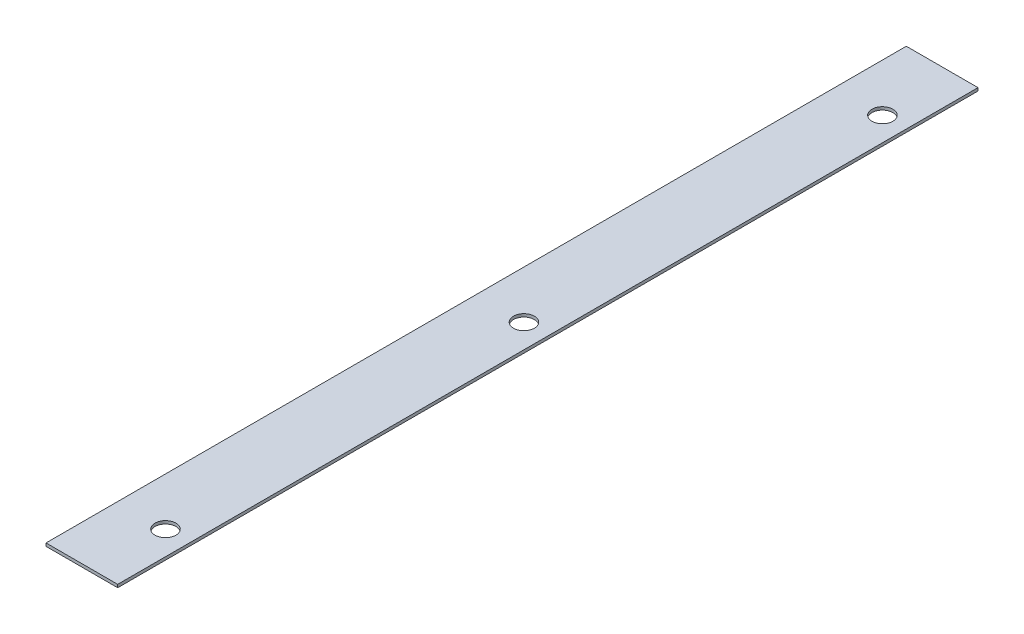
ISO-10303-21;
HEADER;
FILE_DESCRIPTION(('STEP AP214'),'2;1');
FILE_NAME('part.step','',(''),(''),'','','');
FILE_SCHEMA(('AUTOMOTIVE_DESIGN { 1 0 10303 214 1 1 1 1 }'));
ENDSEC;
DATA;
#1=APPLICATION_CONTEXT('core data for automotive mechanical design processes');
#2=APPLICATION_PROTOCOL_DEFINITION('international standard','automotive_design',2000,#1);
#3=PRODUCT_CONTEXT('',#1,'mechanical');
#4=PRODUCT('Part','Part','',(#3));
#5=PRODUCT_RELATED_PRODUCT_CATEGORY('part','',(#4));
#6=PRODUCT_DEFINITION_FORMATION('','',#4);
#7=PRODUCT_DEFINITION_CONTEXT('part definition',#1,'design');
#8=PRODUCT_DEFINITION('design','',#6,#7);
#9=PRODUCT_DEFINITION_SHAPE('','',#8);
#10=(LENGTH_UNIT() NAMED_UNIT(*) SI_UNIT(.MILLI.,.METRE.));
#11=(NAMED_UNIT(*) PLANE_ANGLE_UNIT() SI_UNIT($,.RADIAN.));
#12=(NAMED_UNIT(*) SI_UNIT($,.STERADIAN.) SOLID_ANGLE_UNIT());
#13=UNCERTAINTY_MEASURE_WITH_UNIT(LENGTH_MEASURE(1.E-05),#10,'distance_accuracy_value','');
#14=(GEOMETRIC_REPRESENTATION_CONTEXT(3) GLOBAL_UNCERTAINTY_ASSIGNED_CONTEXT((#13)) GLOBAL_UNIT_ASSIGNED_CONTEXT((#10,
#11,#12)) REPRESENTATION_CONTEXT('',''));
#15=CARTESIAN_POINT('',(0.,0.,0.));
#16=DIRECTION('',(0.,0.,1.));
#17=DIRECTION('',(1.,0.,0.));
#18=AXIS2_PLACEMENT_3D('',#15,#16,#17);
#19=CARTESIAN_POINT('',(0.,3.175,0.));
#20=DIRECTION('',(1.,0.,0.));
#21=DIRECTION('',(0.,0.,-1.));
#22=AXIS2_PLACEMENT_3D('',#19,#20,#21);
#23=PLANE('',#22);
#24=DIRECTION('',(0.,0.,1.));
#25=VECTOR('',#24,1.);
#26=CARTESIAN_POINT('',(0.,0.,0.));
#27=LINE('',#26,#25);
#28=CARTESIAN_POINT('',(0.,0.,-914.4));
#29=VERTEX_POINT('',#28);
#30=CARTESIAN_POINT('',(0.,0.,0.));
#31=VERTEX_POINT('',#30);
#32=EDGE_CURVE('E80',#29,#31,#27,.T.);
#33=ORIENTED_EDGE('',*,*,#32,.T.);
#34=DIRECTION('',(0.,-1.,0.));
#35=VECTOR('',#34,1.);
#36=CARTESIAN_POINT('',(0.,3.175,0.));
#37=LINE('',#36,#35);
#38=CARTESIAN_POINT('',(0.,3.175,0.));
#39=VERTEX_POINT('',#38);
#40=EDGE_CURVE('E11',#39,#31,#37,.T.);
#41=ORIENTED_EDGE('',*,*,#40,.F.);
#42=DIRECTION('',(0.,0.,1.));
#43=VECTOR('',#42,1.);
#44=CARTESIAN_POINT('',(0.,3.175,0.));
#45=LINE('',#44,#43);
#46=CARTESIAN_POINT('',(0.,3.175,-914.4));
#47=VERTEX_POINT('',#46);
#48=EDGE_CURVE('E68',#47,#39,#45,.T.);
#49=ORIENTED_EDGE('',*,*,#48,.F.);
#50=DIRECTION('',(0.,-1.,0.));
#51=VECTOR('',#50,1.);
#52=CARTESIAN_POINT('',(0.,3.175,-914.4));
#53=LINE('',#52,#51);
#54=EDGE_CURVE('E76',#47,#29,#53,.T.);
#55=ORIENTED_EDGE('',*,*,#54,.T.);
#56=EDGE_LOOP('',(#33,#41,#49,#55));
#57=FACE_BOUND('',#56,.T.);
#58=ADVANCED_FACE('F17',(#57),#23,.F.);
#59=CARTESIAN_POINT('',(0.,3.175,0.));
#60=DIRECTION('',(0.,0.,-1.));
#61=DIRECTION('',(-1.,0.,0.));
#62=AXIS2_PLACEMENT_3D('',#59,#60,#61);
#63=PLANE('',#62);
#64=DIRECTION('',(1.,0.,0.));
#65=VECTOR('',#64,1.);
#66=CARTESIAN_POINT('',(0.,0.,0.));
#67=LINE('',#66,#65);
#68=CARTESIAN_POINT('',(76.2,0.,0.));
#69=VERTEX_POINT('',#68);
#70=EDGE_CURVE('E72',#31,#69,#67,.T.);
#71=ORIENTED_EDGE('',*,*,#70,.T.);
#72=DIRECTION('',(0.,-1.,0.));
#73=VECTOR('',#72,1.);
#74=CARTESIAN_POINT('',(76.2,3.175,0.));
#75=LINE('',#74,#73);
#76=CARTESIAN_POINT('',(76.2,3.175,0.));
#77=VERTEX_POINT('',#76);
#78=EDGE_CURVE('E25',#77,#69,#75,.T.);
#79=ORIENTED_EDGE('',*,*,#78,.F.);
#80=DIRECTION('',(1.,0.,0.));
#81=VECTOR('',#80,1.);
#82=CARTESIAN_POINT('',(0.,3.175,0.));
#83=LINE('',#82,#81);
#84=EDGE_CURVE('E63',#39,#77,#83,.T.);
#85=ORIENTED_EDGE('',*,*,#84,.F.);
#86=ORIENTED_EDGE('',*,*,#40,.T.);
#87=EDGE_LOOP('',(#71,#79,#85,#86));
#88=FACE_BOUND('',#87,.T.);
#89=ADVANCED_FACE('F71',(#88),#63,.F.);
#90=CARTESIAN_POINT('',(76.2,3.175,0.));
#91=DIRECTION('',(-1.,0.,0.));
#92=DIRECTION('',(0.,0.,1.));
#93=AXIS2_PLACEMENT_3D('',#90,#91,#92);
#94=PLANE('',#93);
#95=DIRECTION('',(0.,0.,-1.));
#96=VECTOR('',#95,1.);
#97=CARTESIAN_POINT('',(76.2,0.,0.));
#98=LINE('',#97,#96);
#99=CARTESIAN_POINT('',(76.2,0.,-914.4));
#100=VERTEX_POINT('',#99);
#101=EDGE_CURVE('E50',#69,#100,#98,.T.);
#102=ORIENTED_EDGE('',*,*,#101,.T.);
#103=DIRECTION('',(0.,-1.,0.));
#104=VECTOR('',#103,1.);
#105=CARTESIAN_POINT('',(76.2,3.175,-914.4));
#106=LINE('',#105,#104);
#107=CARTESIAN_POINT('',(76.2,3.175,-914.4));
#108=VERTEX_POINT('',#107);
#109=EDGE_CURVE('E73',#108,#100,#106,.T.);
#110=ORIENTED_EDGE('',*,*,#109,.F.);
#111=DIRECTION('',(0.,0.,-1.));
#112=VECTOR('',#111,1.);
#113=CARTESIAN_POINT('',(76.2,3.175,0.));
#114=LINE('',#113,#112);
#115=EDGE_CURVE('E66',#77,#108,#114,.T.);
#116=ORIENTED_EDGE('',*,*,#115,.F.);
#117=ORIENTED_EDGE('',*,*,#78,.T.);
#118=EDGE_LOOP('',(#102,#110,#116,#117));
#119=FACE_BOUND('',#118,.T.);
#120=ADVANCED_FACE('F74',(#119),#94,.F.);
#121=CARTESIAN_POINT('',(0.,3.175,-914.4));
#122=DIRECTION('',(0.,0.,1.));
#123=DIRECTION('',(1.,0.,0.));
#124=AXIS2_PLACEMENT_3D('',#121,#122,#123);
#125=PLANE('',#124);
#126=DIRECTION('',(-1.,0.,0.));
#127=VECTOR('',#126,1.);
#128=CARTESIAN_POINT('',(0.,0.,-914.4));
#129=LINE('',#128,#127);
#130=EDGE_CURVE('E56',#100,#29,#129,.T.);
#131=ORIENTED_EDGE('',*,*,#130,.T.);
#132=ORIENTED_EDGE('',*,*,#54,.F.);
#133=DIRECTION('',(-1.,0.,0.));
#134=VECTOR('',#133,1.);
#135=CARTESIAN_POINT('',(0.,3.175,-914.4));
#136=LINE('',#135,#134);
#137=EDGE_CURVE('E33',#108,#47,#136,.T.);
#138=ORIENTED_EDGE('',*,*,#137,.F.);
#139=ORIENTED_EDGE('',*,*,#109,.T.);
#140=EDGE_LOOP('',(#131,#132,#138,#139));
#141=FACE_BOUND('',#140,.T.);
#142=ADVANCED_FACE('F88',(#141),#125,.F.);
#143=CARTESIAN_POINT('',(0.,3.175,-914.4));
#144=DIRECTION('',(0.,-1.,0.));
#145=DIRECTION('',(0.,0.,-1.));
#146=AXIS2_PLACEMENT_3D('',#143,#144,#145);
#147=PLANE('',#146);
#148=CARTESIAN_POINT('',(50.7999999999976,3.175,-76.2));
#149=DIRECTION('',(0.,1.,0.));
#150=DIRECTION('',(0.,0.,-1.));
#151=AXIS2_PLACEMENT_3D('',#148,#149,#150);
#152=CIRCLE('',#151,11.1125);
#153=CARTESIAN_POINT('',(50.7999999999976,3.175,-87.3125));
#154=VERTEX_POINT('',#153);
#155=EDGE_CURVE('E103',#154,#154,#152,.T.);
#156=ORIENTED_EDGE('',*,*,#155,.F.);
#157=EDGE_LOOP('',(#156));
#158=FACE_BOUND('',#157,.T.);
#159=CARTESIAN_POINT('',(50.8,3.175,-457.2));
#160=DIRECTION('',(0.,1.,0.));
#161=DIRECTION('',(0.,0.,1.));
#162=AXIS2_PLACEMENT_3D('',#159,#160,#161);
#163=CIRCLE('',#162,11.1125);
#164=CARTESIAN_POINT('',(50.8,3.175,-446.0875));
#165=VERTEX_POINT('',#164);
#166=EDGE_CURVE('E97',#165,#165,#163,.T.);
#167=ORIENTED_EDGE('',*,*,#166,.F.);
#168=EDGE_LOOP('',(#167));
#169=FACE_BOUND('',#168,.T.);
#170=CARTESIAN_POINT('',(50.8,3.175,-838.2));
#171=DIRECTION('',(0.,1.,0.));
#172=DIRECTION('',(0.,0.,1.));
#173=AXIS2_PLACEMENT_3D('',#170,#171,#172);
#174=CIRCLE('',#173,11.1125);
#175=CARTESIAN_POINT('',(50.8,3.175,-827.0875));
#176=VERTEX_POINT('',#175);
#177=EDGE_CURVE('E83',#176,#176,#174,.T.);
#178=ORIENTED_EDGE('',*,*,#177,.F.);
#179=EDGE_LOOP('',(#178));
#180=FACE_BOUND('',#179,.T.);
#181=ORIENTED_EDGE('',*,*,#48,.T.);
#182=ORIENTED_EDGE('',*,*,#84,.T.);
#183=ORIENTED_EDGE('',*,*,#115,.T.);
#184=ORIENTED_EDGE('',*,*,#137,.T.);
#185=EDGE_LOOP('',(#181,#182,#183,#184));
#186=FACE_BOUND('',#185,.T.);
#187=ADVANCED_FACE('F64',(#158,#169,#180,#186),#147,.F.);
#188=CARTESIAN_POINT('',(0.,0.,-914.4));
#189=DIRECTION('',(0.,-1.,0.));
#190=DIRECTION('',(0.,0.,-1.));
#191=AXIS2_PLACEMENT_3D('',#188,#189,#190);
#192=PLANE('',#191);
#193=CARTESIAN_POINT('',(50.7999999999976,0.,-76.2));
#194=DIRECTION('',(0.,-1.,0.));
#195=DIRECTION('',(0.,0.,-1.));
#196=AXIS2_PLACEMENT_3D('',#193,#194,#195);
#197=CIRCLE('',#196,11.1125);
#198=CARTESIAN_POINT('',(50.7999999999976,0.,-87.3125));
#199=VERTEX_POINT('',#198);
#200=EDGE_CURVE('E106',#199,#199,#197,.F.);
#201=ORIENTED_EDGE('',*,*,#200,.T.);
#202=EDGE_LOOP('',(#201));
#203=FACE_BOUND('',#202,.T.);
#204=CARTESIAN_POINT('',(50.8,0.,-457.2));
#205=DIRECTION('',(0.,-1.,0.));
#206=DIRECTION('',(0.,0.,-1.));
#207=AXIS2_PLACEMENT_3D('',#204,#205,#206);
#208=CIRCLE('',#207,11.1125);
#209=CARTESIAN_POINT('',(50.8,0.,-468.3125));
#210=VERTEX_POINT('',#209);
#211=EDGE_CURVE('E100',#210,#210,#208,.F.);
#212=ORIENTED_EDGE('',*,*,#211,.T.);
#213=EDGE_LOOP('',(#212));
#214=FACE_BOUND('',#213,.T.);
#215=CARTESIAN_POINT('',(50.8,0.,-838.2));
#216=DIRECTION('',(0.,-1.,0.));
#217=DIRECTION('',(0.,0.,-1.));
#218=AXIS2_PLACEMENT_3D('',#215,#216,#217);
#219=CIRCLE('',#218,11.1125);
#220=CARTESIAN_POINT('',(50.8,0.,-849.3125));
#221=VERTEX_POINT('',#220);
#222=EDGE_CURVE('E94',#221,#221,#219,.F.);
#223=ORIENTED_EDGE('',*,*,#222,.T.);
#224=EDGE_LOOP('',(#223));
#225=FACE_BOUND('',#224,.T.);
#226=ORIENTED_EDGE('',*,*,#32,.F.);
#227=ORIENTED_EDGE('',*,*,#130,.F.);
#228=ORIENTED_EDGE('',*,*,#101,.F.);
#229=ORIENTED_EDGE('',*,*,#70,.F.);
#230=EDGE_LOOP('',(#226,#227,#228,#229));
#231=FACE_BOUND('',#230,.T.);
#232=ADVANCED_FACE('F91',(#203,#214,#225,#231),#192,.T.);
#233=CARTESIAN_POINT('',(50.8,-0.00100000000000013,-838.2));
#234=DIRECTION('',(0.,1.,0.));
#235=DIRECTION('',(0.,0.,1.));
#236=AXIS2_PLACEMENT_3D('',#233,#234,#235);
#237=CYLINDRICAL_SURFACE('',#236,11.1125);
#238=ORIENTED_EDGE('',*,*,#222,.F.);
#239=EDGE_LOOP('',(#238));
#240=FACE_BOUND('',#239,.T.);
#241=ORIENTED_EDGE('',*,*,#177,.T.);
#242=EDGE_LOOP('',(#241));
#243=FACE_BOUND('',#242,.T.);
#244=ADVANCED_FACE('F121',(#240,#243),#237,.F.);
#245=CARTESIAN_POINT('',(50.8,-0.00100000000000013,-457.2));
#246=DIRECTION('',(0.,1.,0.));
#247=DIRECTION('',(0.,0.,1.));
#248=AXIS2_PLACEMENT_3D('',#245,#246,#247);
#249=CYLINDRICAL_SURFACE('',#248,11.1125);
#250=ORIENTED_EDGE('',*,*,#211,.F.);
#251=EDGE_LOOP('',(#250));
#252=FACE_BOUND('',#251,.T.);
#253=ORIENTED_EDGE('',*,*,#166,.T.);
#254=EDGE_LOOP('',(#253));
#255=FACE_BOUND('',#254,.T.);
#256=ADVANCED_FACE('F123',(#252,#255),#249,.F.);
#257=CARTESIAN_POINT('',(50.7999999999976,-0.00100000000000013,-76.2));
#258=DIRECTION('',(0.,1.,0.));
#259=DIRECTION('',(0.,0.,1.));
#260=AXIS2_PLACEMENT_3D('',#257,#258,#259);
#261=CYLINDRICAL_SURFACE('',#260,11.1125);
#262=ORIENTED_EDGE('',*,*,#200,.F.);
#263=EDGE_LOOP('',(#262));
#264=FACE_BOUND('',#263,.T.);
#265=ORIENTED_EDGE('',*,*,#155,.T.);
#266=EDGE_LOOP('',(#265));
#267=FACE_BOUND('',#266,.T.);
#268=ADVANCED_FACE('F112',(#264,#267),#261,.F.);
#269=CLOSED_SHELL('',(#58,#89,#120,#142,#187,#232,#244,#256,#268));
#270=MANIFOLD_SOLID_BREP('B1',#269);
#271=ADVANCED_BREP_SHAPE_REPRESENTATION('',(#18,#270),#14);
#272=SHAPE_DEFINITION_REPRESENTATION(#9,#271);
ENDSEC;
END-ISO-10303-21;
